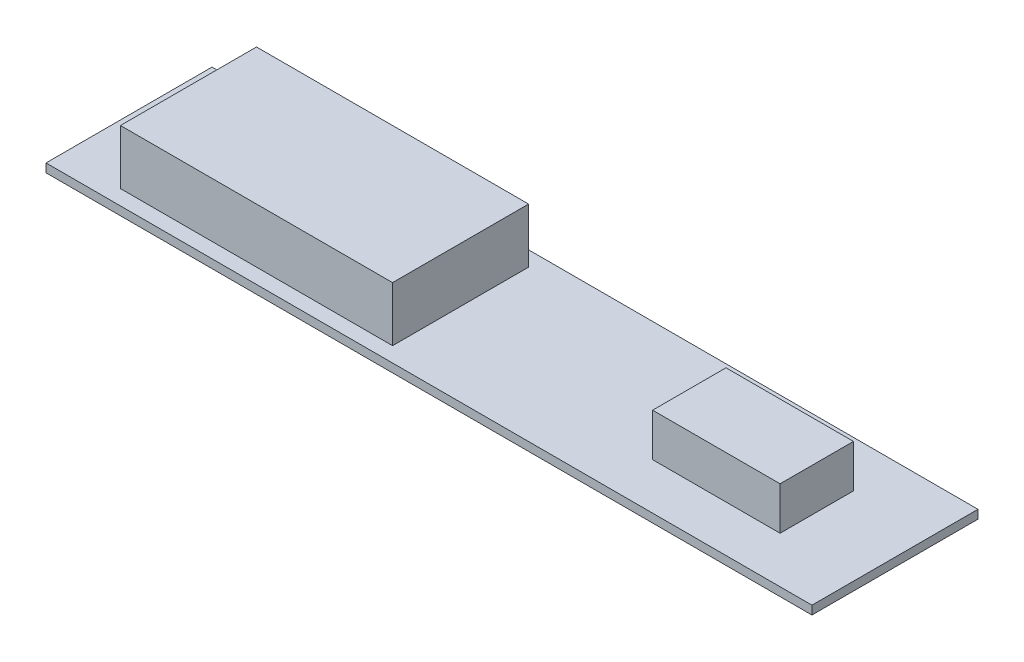
ISO-10303-21;
HEADER;
FILE_DESCRIPTION(('STEP AP214'),'2;1');
FILE_NAME('part.step','',(''),(''),'','','');
FILE_SCHEMA(('AUTOMOTIVE_DESIGN { 1 0 10303 214 1 1 1 1 }'));
ENDSEC;
DATA;
#1=APPLICATION_CONTEXT('core data for automotive mechanical design processes');
#2=APPLICATION_PROTOCOL_DEFINITION('international standard','automotive_design',2000,#1);
#3=PRODUCT_CONTEXT('',#1,'mechanical');
#4=PRODUCT('Part','Part','',(#3));
#5=PRODUCT_RELATED_PRODUCT_CATEGORY('part','',(#4));
#6=PRODUCT_DEFINITION_FORMATION('','',#4);
#7=PRODUCT_DEFINITION_CONTEXT('part definition',#1,'design');
#8=PRODUCT_DEFINITION('design','',#6,#7);
#9=PRODUCT_DEFINITION_SHAPE('','',#8);
#10=(LENGTH_UNIT() NAMED_UNIT(*) SI_UNIT(.MILLI.,.METRE.));
#11=(NAMED_UNIT(*) PLANE_ANGLE_UNIT() SI_UNIT($,.RADIAN.));
#12=(NAMED_UNIT(*) SI_UNIT($,.STERADIAN.) SOLID_ANGLE_UNIT());
#13=UNCERTAINTY_MEASURE_WITH_UNIT(LENGTH_MEASURE(1.E-05),#10,'distance_accuracy_value','');
#14=(GEOMETRIC_REPRESENTATION_CONTEXT(3) GLOBAL_UNCERTAINTY_ASSIGNED_CONTEXT((#13)) GLOBAL_UNIT_ASSIGNED_CONTEXT((#10,
#11,#12)) REPRESENTATION_CONTEXT('',''));
#15=CARTESIAN_POINT('',(0.,0.,0.));
#16=DIRECTION('',(0.,0.,1.));
#17=DIRECTION('',(1.,0.,0.));
#18=AXIS2_PLACEMENT_3D('',#15,#16,#17);
#19=CARTESIAN_POINT('',(0.,1.6,0.));
#20=DIRECTION('',(0.,-1.,0.));
#21=DIRECTION('',(0.,0.,-1.));
#22=AXIS2_PLACEMENT_3D('',#19,#20,#21);
#23=PLANE('',#22);
#24=DIRECTION('',(0.,0.,-1.));
#25=VECTOR('',#24,1.);
#26=CARTESIAN_POINT('',(56.9,1.6,6.85));
#27=LINE('',#26,#25);
#28=CARTESIAN_POINT('',(56.9,1.6,6.85));
#29=VERTEX_POINT('',#28);
#30=CARTESIAN_POINT('',(56.9,1.6,-6.85));
#31=VERTEX_POINT('',#30);
#32=EDGE_CURVE('E148',#29,#31,#27,.T.);
#33=ORIENTED_EDGE('',*,*,#32,.F.);
#34=DIRECTION('',(1.,0.,0.));
#35=VECTOR('',#34,1.);
#36=CARTESIAN_POINT('',(33.1,1.6,6.85));
#37=LINE('',#36,#35);
#38=CARTESIAN_POINT('',(33.1,1.6,6.85));
#39=VERTEX_POINT('',#38);
#40=EDGE_CURVE('E161',#39,#29,#37,.T.);
#41=ORIENTED_EDGE('',*,*,#40,.F.);
#42=DIRECTION('',(0.,0.,1.));
#43=VECTOR('',#42,1.);
#44=CARTESIAN_POINT('',(33.1,1.6,6.85));
#45=LINE('',#44,#43);
#46=CARTESIAN_POINT('',(33.1,1.6,-6.85));
#47=VERTEX_POINT('',#46);
#48=EDGE_CURVE('E170',#47,#39,#45,.T.);
#49=ORIENTED_EDGE('',*,*,#48,.F.);
#50=DIRECTION('',(-1.,0.,0.));
#51=VECTOR('',#50,1.);
#52=CARTESIAN_POINT('',(33.1,1.6,-6.85));
#53=LINE('',#52,#51);
#54=EDGE_CURVE('E151',#31,#47,#53,.T.);
#55=ORIENTED_EDGE('',*,*,#54,.F.);
#56=EDGE_LOOP('',(#33,#41,#49,#55));
#57=FACE_BOUND('',#56,.T.);
#58=DIRECTION('',(0.,0.,-1.));
#59=VECTOR('',#58,1.);
#60=CARTESIAN_POINT('',(71.5,1.6,15.5));
#61=LINE('',#60,#59);
#62=CARTESIAN_POINT('',(71.5,1.6,15.5));
#63=VERTEX_POINT('',#62);
#64=CARTESIAN_POINT('',(71.5,1.6,-15.5));
#65=VERTEX_POINT('',#64);
#66=EDGE_CURVE('E187',#63,#65,#61,.T.);
#67=ORIENTED_EDGE('',*,*,#66,.T.);
#68=DIRECTION('',(-1.,0.,0.));
#69=VECTOR('',#68,1.);
#70=CARTESIAN_POINT('',(-71.5,1.6,-15.5));
#71=LINE('',#70,#69);
#72=CARTESIAN_POINT('',(-71.5,1.6,-15.5));
#73=VERTEX_POINT('',#72);
#74=EDGE_CURVE('E190',#65,#73,#71,.T.);
#75=ORIENTED_EDGE('',*,*,#74,.T.);
#76=DIRECTION('',(0.,0.,1.));
#77=VECTOR('',#76,1.);
#78=CARTESIAN_POINT('',(-71.5,1.6,15.5));
#79=LINE('',#78,#77);
#80=CARTESIAN_POINT('',(-71.5,1.6,15.5));
#81=VERTEX_POINT('',#80);
#82=EDGE_CURVE('E193',#73,#81,#79,.T.);
#83=ORIENTED_EDGE('',*,*,#82,.T.);
#84=DIRECTION('',(1.,0.,0.));
#85=VECTOR('',#84,1.);
#86=CARTESIAN_POINT('',(-71.5,1.6,15.5));
#87=LINE('',#86,#85);
#88=EDGE_CURVE('E195',#81,#63,#87,.T.);
#89=ORIENTED_EDGE('',*,*,#88,.T.);
#90=EDGE_LOOP('',(#67,#75,#83,#89));
#91=FACE_BOUND('',#90,.T.);
#92=DIRECTION('',(0.,0.,-1.));
#93=VECTOR('',#92,1.);
#94=CARTESIAN_POINT('',(-9.6,1.6,12.7));
#95=LINE('',#94,#93);
#96=CARTESIAN_POINT('',(-9.6,1.6,12.7));
#97=VERTEX_POINT('',#96);
#98=CARTESIAN_POINT('',(-9.6,1.6,-12.7));
#99=VERTEX_POINT('',#98);
#100=EDGE_CURVE('E147',#97,#99,#95,.T.);
#101=ORIENTED_EDGE('',*,*,#100,.F.);
#102=DIRECTION('',(1.,0.,0.));
#103=VECTOR('',#102,1.);
#104=CARTESIAN_POINT('',(-60.4,1.6,12.7));
#105=LINE('',#104,#103);
#106=CARTESIAN_POINT('',(-60.4,1.6,12.7));
#107=VERTEX_POINT('',#106);
#108=EDGE_CURVE('E144',#107,#97,#105,.T.);
#109=ORIENTED_EDGE('',*,*,#108,.F.);
#110=DIRECTION('',(0.,0.,1.));
#111=VECTOR('',#110,1.);
#112=CARTESIAN_POINT('',(-60.4,1.6,12.7));
#113=LINE('',#112,#111);
#114=CARTESIAN_POINT('',(-60.4,1.6,-12.7));
#115=VERTEX_POINT('',#114);
#116=EDGE_CURVE('E58',#115,#107,#113,.T.);
#117=ORIENTED_EDGE('',*,*,#116,.F.);
#118=DIRECTION('',(-1.,0.,0.));
#119=VECTOR('',#118,1.);
#120=CARTESIAN_POINT('',(-60.4,1.6,-12.7));
#121=LINE('',#120,#119);
#122=EDGE_CURVE('E53',#99,#115,#121,.T.);
#123=ORIENTED_EDGE('',*,*,#122,.F.);
#124=EDGE_LOOP('',(#101,#109,#117,#123));
#125=FACE_BOUND('',#124,.T.);
#126=ADVANCED_FACE('F38',(#57,#91,#125),#23,.F.);
#127=CARTESIAN_POINT('',(71.5,1.6,15.5));
#128=DIRECTION('',(-1.,0.,0.));
#129=DIRECTION('',(0.,0.,1.));
#130=AXIS2_PLACEMENT_3D('',#127,#128,#129);
#131=PLANE('',#130);
#132=DIRECTION('',(0.,0.,-1.));
#133=VECTOR('',#132,1.);
#134=CARTESIAN_POINT('',(71.5,0.,15.5));
#135=LINE('',#134,#133);
#136=CARTESIAN_POINT('',(71.5,0.,15.5));
#137=VERTEX_POINT('',#136);
#138=CARTESIAN_POINT('',(71.5,0.,-15.5));
#139=VERTEX_POINT('',#138);
#140=EDGE_CURVE('E186',#137,#139,#135,.T.);
#141=ORIENTED_EDGE('',*,*,#140,.T.);
#142=DIRECTION('',(0.,-1.,0.));
#143=VECTOR('',#142,1.);
#144=CARTESIAN_POINT('',(71.5,1.6,-15.5));
#145=LINE('',#144,#143);
#146=EDGE_CURVE('E11',#65,#139,#145,.T.);
#147=ORIENTED_EDGE('',*,*,#146,.F.);
#148=ORIENTED_EDGE('',*,*,#66,.F.);
#149=DIRECTION('',(0.,-1.,0.));
#150=VECTOR('',#149,1.);
#151=CARTESIAN_POINT('',(71.5,1.6,15.5));
#152=LINE('',#151,#150);
#153=EDGE_CURVE('E197',#63,#137,#152,.T.);
#154=ORIENTED_EDGE('',*,*,#153,.T.);
#155=EDGE_LOOP('',(#141,#147,#148,#154));
#156=FACE_BOUND('',#155,.T.);
#157=ADVANCED_FACE('F40',(#156),#131,.F.);
#158=CARTESIAN_POINT('',(-71.5,1.6,-15.5));
#159=DIRECTION('',(0.,0.,1.));
#160=DIRECTION('',(1.,0.,0.));
#161=AXIS2_PLACEMENT_3D('',#158,#159,#160);
#162=PLANE('',#161);
#163=DIRECTION('',(-1.,0.,0.));
#164=VECTOR('',#163,1.);
#165=CARTESIAN_POINT('',(-71.5,0.,-15.5));
#166=LINE('',#165,#164);
#167=CARTESIAN_POINT('',(-71.5,0.,-15.5));
#168=VERTEX_POINT('',#167);
#169=EDGE_CURVE('E200',#139,#168,#166,.T.);
#170=ORIENTED_EDGE('',*,*,#169,.T.);
#171=DIRECTION('',(0.,-1.,0.));
#172=VECTOR('',#171,1.);
#173=CARTESIAN_POINT('',(-71.5,1.6,-15.5));
#174=LINE('',#173,#172);
#175=EDGE_CURVE('E46',#73,#168,#174,.T.);
#176=ORIENTED_EDGE('',*,*,#175,.F.);
#177=ORIENTED_EDGE('',*,*,#74,.F.);
#178=ORIENTED_EDGE('',*,*,#146,.T.);
#179=EDGE_LOOP('',(#170,#176,#177,#178));
#180=FACE_BOUND('',#179,.T.);
#181=ADVANCED_FACE('F229',(#180),#162,.F.);
#182=CARTESIAN_POINT('',(-71.5,1.6,15.5));
#183=DIRECTION('',(1.,0.,0.));
#184=DIRECTION('',(0.,0.,-1.));
#185=AXIS2_PLACEMENT_3D('',#182,#183,#184);
#186=PLANE('',#185);
#187=DIRECTION('',(0.,0.,1.));
#188=VECTOR('',#187,1.);
#189=CARTESIAN_POINT('',(-71.5,0.,15.5));
#190=LINE('',#189,#188);
#191=CARTESIAN_POINT('',(-71.5,0.,15.5));
#192=VERTEX_POINT('',#191);
#193=EDGE_CURVE('E202',#168,#192,#190,.T.);
#194=ORIENTED_EDGE('',*,*,#193,.T.);
#195=DIRECTION('',(0.,-1.,0.));
#196=VECTOR('',#195,1.);
#197=CARTESIAN_POINT('',(-71.5,1.6,15.5));
#198=LINE('',#197,#196);
#199=EDGE_CURVE('E207',#81,#192,#198,.T.);
#200=ORIENTED_EDGE('',*,*,#199,.F.);
#201=ORIENTED_EDGE('',*,*,#82,.F.);
#202=ORIENTED_EDGE('',*,*,#175,.T.);
#203=EDGE_LOOP('',(#194,#200,#201,#202));
#204=FACE_BOUND('',#203,.T.);
#205=ADVANCED_FACE('F214',(#204),#186,.F.);
#206=CARTESIAN_POINT('',(-71.5,1.6,15.5));
#207=DIRECTION('',(0.,0.,-1.));
#208=DIRECTION('',(-1.,0.,0.));
#209=AXIS2_PLACEMENT_3D('',#206,#207,#208);
#210=PLANE('',#209);
#211=DIRECTION('',(1.,0.,0.));
#212=VECTOR('',#211,1.);
#213=CARTESIAN_POINT('',(-71.5,0.,15.5));
#214=LINE('',#213,#212);
#215=EDGE_CURVE('E191',#192,#137,#214,.T.);
#216=ORIENTED_EDGE('',*,*,#215,.T.);
#217=ORIENTED_EDGE('',*,*,#153,.F.);
#218=ORIENTED_EDGE('',*,*,#88,.F.);
#219=ORIENTED_EDGE('',*,*,#199,.T.);
#220=EDGE_LOOP('',(#216,#217,#218,#219));
#221=FACE_BOUND('',#220,.T.);
#222=ADVANCED_FACE('F223',(#221),#210,.F.);
#223=CARTESIAN_POINT('',(0.,0.,0.));
#224=DIRECTION('',(0.,-1.,0.));
#225=DIRECTION('',(0.,0.,-1.));
#226=AXIS2_PLACEMENT_3D('',#223,#224,#225);
#227=PLANE('',#226);
#228=ORIENTED_EDGE('',*,*,#140,.F.);
#229=ORIENTED_EDGE('',*,*,#215,.F.);
#230=ORIENTED_EDGE('',*,*,#193,.F.);
#231=ORIENTED_EDGE('',*,*,#169,.F.);
#232=EDGE_LOOP('',(#228,#229,#230,#231));
#233=FACE_BOUND('',#232,.T.);
#234=ADVANCED_FACE('F220',(#233),#227,.T.);
#235=CARTESIAN_POINT('',(56.9,9.6,6.85));
#236=DIRECTION('',(-1.,0.,0.));
#237=DIRECTION('',(0.,0.,1.));
#238=AXIS2_PLACEMENT_3D('',#235,#236,#237);
#239=PLANE('',#238);
#240=ORIENTED_EDGE('',*,*,#32,.T.);
#241=DIRECTION('',(0.,-1.,0.));
#242=VECTOR('',#241,1.);
#243=CARTESIAN_POINT('',(56.9,9.6,-6.85));
#244=LINE('',#243,#242);
#245=CARTESIAN_POINT('',(56.9,9.6,-6.85));
#246=VERTEX_POINT('',#245);
#247=EDGE_CURVE('E183',#246,#31,#244,.T.);
#248=ORIENTED_EDGE('',*,*,#247,.F.);
#249=DIRECTION('',(0.,0.,-1.));
#250=VECTOR('',#249,1.);
#251=CARTESIAN_POINT('',(56.9,9.6,6.85));
#252=LINE('',#251,#250);
#253=CARTESIAN_POINT('',(56.9,9.6,6.85));
#254=VERTEX_POINT('',#253);
#255=EDGE_CURVE('E157',#254,#246,#252,.T.);
#256=ORIENTED_EDGE('',*,*,#255,.F.);
#257=DIRECTION('',(0.,-1.,0.));
#258=VECTOR('',#257,1.);
#259=CARTESIAN_POINT('',(56.9,9.6,6.85));
#260=LINE('',#259,#258);
#261=EDGE_CURVE('E166',#254,#29,#260,.T.);
#262=ORIENTED_EDGE('',*,*,#261,.T.);
#263=EDGE_LOOP('',(#240,#248,#256,#262));
#264=FACE_BOUND('',#263,.T.);
#265=ADVANCED_FACE('F243',(#264),#239,.F.);
#266=CARTESIAN_POINT('',(33.1,9.6,-6.85));
#267=DIRECTION('',(0.,0.,1.));
#268=DIRECTION('',(1.,0.,0.));
#269=AXIS2_PLACEMENT_3D('',#266,#267,#268);
#270=PLANE('',#269);
#271=ORIENTED_EDGE('',*,*,#54,.T.);
#272=DIRECTION('',(0.,-1.,0.));
#273=VECTOR('',#272,1.);
#274=CARTESIAN_POINT('',(33.1,9.6,-6.85));
#275=LINE('',#274,#273);
#276=CARTESIAN_POINT('',(33.1,9.6,-6.85));
#277=VERTEX_POINT('',#276);
#278=EDGE_CURVE('E180',#277,#47,#275,.T.);
#279=ORIENTED_EDGE('',*,*,#278,.F.);
#280=DIRECTION('',(-1.,0.,0.));
#281=VECTOR('',#280,1.);
#282=CARTESIAN_POINT('',(33.1,9.6,-6.85));
#283=LINE('',#282,#281);
#284=EDGE_CURVE('E160',#246,#277,#283,.T.);
#285=ORIENTED_EDGE('',*,*,#284,.F.);
#286=ORIENTED_EDGE('',*,*,#247,.T.);
#287=EDGE_LOOP('',(#271,#279,#285,#286));
#288=FACE_BOUND('',#287,.T.);
#289=ADVANCED_FACE('F262',(#288),#270,.F.);
#290=CARTESIAN_POINT('',(33.1,9.6,6.85));
#291=DIRECTION('',(1.,0.,0.));
#292=DIRECTION('',(0.,0.,-1.));
#293=AXIS2_PLACEMENT_3D('',#290,#291,#292);
#294=PLANE('',#293);
#295=ORIENTED_EDGE('',*,*,#48,.T.);
#296=DIRECTION('',(0.,-1.,0.));
#297=VECTOR('',#296,1.);
#298=CARTESIAN_POINT('',(33.1,9.6,6.85));
#299=LINE('',#298,#297);
#300=CARTESIAN_POINT('',(33.1,9.6,6.85));
#301=VERTEX_POINT('',#300);
#302=EDGE_CURVE('E177',#301,#39,#299,.T.);
#303=ORIENTED_EDGE('',*,*,#302,.F.);
#304=DIRECTION('',(0.,0.,1.));
#305=VECTOR('',#304,1.);
#306=CARTESIAN_POINT('',(33.1,9.6,6.85));
#307=LINE('',#306,#305);
#308=EDGE_CURVE('E163',#277,#301,#307,.T.);
#309=ORIENTED_EDGE('',*,*,#308,.F.);
#310=ORIENTED_EDGE('',*,*,#278,.T.);
#311=EDGE_LOOP('',(#295,#303,#309,#310));
#312=FACE_BOUND('',#311,.T.);
#313=ADVANCED_FACE('F269',(#312),#294,.F.);
#314=CARTESIAN_POINT('',(33.1,9.6,6.85));
#315=DIRECTION('',(0.,0.,-1.));
#316=DIRECTION('',(-1.,0.,0.));
#317=AXIS2_PLACEMENT_3D('',#314,#315,#316);
#318=PLANE('',#317);
#319=ORIENTED_EDGE('',*,*,#40,.T.);
#320=ORIENTED_EDGE('',*,*,#261,.F.);
#321=DIRECTION('',(1.,0.,0.));
#322=VECTOR('',#321,1.);
#323=CARTESIAN_POINT('',(33.1,9.6,6.85));
#324=LINE('',#323,#322);
#325=EDGE_CURVE('E165',#301,#254,#324,.T.);
#326=ORIENTED_EDGE('',*,*,#325,.F.);
#327=ORIENTED_EDGE('',*,*,#302,.T.);
#328=EDGE_LOOP('',(#319,#320,#326,#327));
#329=FACE_BOUND('',#328,.T.);
#330=ADVANCED_FACE('F276',(#329),#318,.F.);
#331=CARTESIAN_POINT('',(0.,9.6,0.));
#332=DIRECTION('',(0.,-1.,0.));
#333=DIRECTION('',(0.,0.,-1.));
#334=AXIS2_PLACEMENT_3D('',#331,#332,#333);
#335=PLANE('',#334);
#336=ORIENTED_EDGE('',*,*,#255,.T.);
#337=ORIENTED_EDGE('',*,*,#284,.T.);
#338=ORIENTED_EDGE('',*,*,#308,.T.);
#339=ORIENTED_EDGE('',*,*,#325,.T.);
#340=EDGE_LOOP('',(#336,#337,#338,#339));
#341=FACE_BOUND('',#340,.T.);
#342=ADVANCED_FACE('F284',(#341),#335,.F.);
#343=CARTESIAN_POINT('',(-9.6,11.8,12.7));
#344=DIRECTION('',(-1.,0.,0.));
#345=DIRECTION('',(0.,0.,1.));
#346=AXIS2_PLACEMENT_3D('',#343,#344,#345);
#347=PLANE('',#346);
#348=ORIENTED_EDGE('',*,*,#100,.T.);
#349=DIRECTION('',(0.,-1.,0.));
#350=VECTOR('',#349,1.);
#351=CARTESIAN_POINT('',(-9.6,11.8,-12.7));
#352=LINE('',#351,#350);
#353=CARTESIAN_POINT('',(-9.6,11.8,-12.7));
#354=VERTEX_POINT('',#353);
#355=EDGE_CURVE('E128',#354,#99,#352,.T.);
#356=ORIENTED_EDGE('',*,*,#355,.F.);
#357=DIRECTION('',(0.,0.,-1.));
#358=VECTOR('',#357,1.);
#359=CARTESIAN_POINT('',(-9.6,11.8,12.7));
#360=LINE('',#359,#358);
#361=CARTESIAN_POINT('',(-9.6,11.8,12.7));
#362=VERTEX_POINT('',#361);
#363=EDGE_CURVE('E135',#362,#354,#360,.T.);
#364=ORIENTED_EDGE('',*,*,#363,.F.);
#365=DIRECTION('',(0.,-1.,0.));
#366=VECTOR('',#365,1.);
#367=CARTESIAN_POINT('',(-9.6,11.8,12.7));
#368=LINE('',#367,#366);
#369=EDGE_CURVE('E373',#362,#97,#368,.T.);
#370=ORIENTED_EDGE('',*,*,#369,.T.);
#371=EDGE_LOOP('',(#348,#356,#364,#370));
#372=FACE_BOUND('',#371,.T.);
#373=ADVANCED_FACE('F146',(#372),#347,.F.);
#374=CARTESIAN_POINT('',(-60.4,11.8,-12.7));
#375=DIRECTION('',(0.,0.,1.));
#376=DIRECTION('',(1.,0.,0.));
#377=AXIS2_PLACEMENT_3D('',#374,#375,#376);
#378=PLANE('',#377);
#379=ORIENTED_EDGE('',*,*,#122,.T.);
#380=DIRECTION('',(0.,-1.,0.));
#381=VECTOR('',#380,1.);
#382=CARTESIAN_POINT('',(-60.4,11.8,-12.7));
#383=LINE('',#382,#381);
#384=CARTESIAN_POINT('',(-60.4,11.8,-12.7));
#385=VERTEX_POINT('',#384);
#386=EDGE_CURVE('E131',#385,#115,#383,.T.);
#387=ORIENTED_EDGE('',*,*,#386,.F.);
#388=DIRECTION('',(-1.,0.,0.));
#389=VECTOR('',#388,1.);
#390=CARTESIAN_POINT('',(-60.4,11.8,-12.7));
#391=LINE('',#390,#389);
#392=EDGE_CURVE('E124',#354,#385,#391,.T.);
#393=ORIENTED_EDGE('',*,*,#392,.F.);
#394=ORIENTED_EDGE('',*,*,#355,.T.);
#395=EDGE_LOOP('',(#379,#387,#393,#394));
#396=FACE_BOUND('',#395,.T.);
#397=ADVANCED_FACE('F126',(#396),#378,.F.);
#398=CARTESIAN_POINT('',(-60.4,11.8,12.7));
#399=DIRECTION('',(1.,0.,0.));
#400=DIRECTION('',(0.,0.,-1.));
#401=AXIS2_PLACEMENT_3D('',#398,#399,#400);
#402=PLANE('',#401);
#403=ORIENTED_EDGE('',*,*,#116,.T.);
#404=DIRECTION('',(0.,-1.,0.));
#405=VECTOR('',#404,1.);
#406=CARTESIAN_POINT('',(-60.4,11.8,12.7));
#407=LINE('',#406,#405);
#408=CARTESIAN_POINT('',(-60.4,11.8,12.7));
#409=VERTEX_POINT('',#408);
#410=EDGE_CURVE('E153',#409,#107,#407,.T.);
#411=ORIENTED_EDGE('',*,*,#410,.F.);
#412=DIRECTION('',(0.,0.,1.));
#413=VECTOR('',#412,1.);
#414=CARTESIAN_POINT('',(-60.4,11.8,12.7));
#415=LINE('',#414,#413);
#416=EDGE_CURVE('E134',#385,#409,#415,.T.);
#417=ORIENTED_EDGE('',*,*,#416,.F.);
#418=ORIENTED_EDGE('',*,*,#386,.T.);
#419=EDGE_LOOP('',(#403,#411,#417,#418));
#420=FACE_BOUND('',#419,.T.);
#421=ADVANCED_FACE('F305',(#420),#402,.F.);
#422=CARTESIAN_POINT('',(-60.4,11.8,12.7));
#423=DIRECTION('',(0.,0.,-1.));
#424=DIRECTION('',(-1.,0.,0.));
#425=AXIS2_PLACEMENT_3D('',#422,#423,#424);
#426=PLANE('',#425);
#427=ORIENTED_EDGE('',*,*,#108,.T.);
#428=ORIENTED_EDGE('',*,*,#369,.F.);
#429=DIRECTION('',(1.,0.,0.));
#430=VECTOR('',#429,1.);
#431=CARTESIAN_POINT('',(-60.4,11.8,12.7));
#432=LINE('',#431,#430);
#433=EDGE_CURVE('E140',#409,#362,#432,.T.);
#434=ORIENTED_EDGE('',*,*,#433,.F.);
#435=ORIENTED_EDGE('',*,*,#410,.T.);
#436=EDGE_LOOP('',(#427,#428,#434,#435));
#437=FACE_BOUND('',#436,.T.);
#438=ADVANCED_FACE('F312',(#437),#426,.F.);
#439=CARTESIAN_POINT('',(0.,11.8,0.));
#440=DIRECTION('',(0.,-1.,0.));
#441=DIRECTION('',(0.,0.,-1.));
#442=AXIS2_PLACEMENT_3D('',#439,#440,#441);
#443=PLANE('',#442);
#444=ORIENTED_EDGE('',*,*,#363,.T.);
#445=ORIENTED_EDGE('',*,*,#392,.T.);
#446=ORIENTED_EDGE('',*,*,#416,.T.);
#447=ORIENTED_EDGE('',*,*,#433,.T.);
#448=EDGE_LOOP('',(#444,#445,#446,#447));
#449=FACE_BOUND('',#448,.T.);
#450=ADVANCED_FACE('F138',(#449),#443,.F.);
#451=CLOSED_SHELL('',(#126,#157,#181,#205,#222,#234,#265,#289,#313,#330,#342,#373,#397,#421,
#438,#450));
#452=MANIFOLD_SOLID_BREP('B2',#451);
#453=ADVANCED_BREP_SHAPE_REPRESENTATION('',(#18,#452),#14);
#454=SHAPE_DEFINITION_REPRESENTATION(#9,#453);
ENDSEC;
END-ISO-10303-21;
